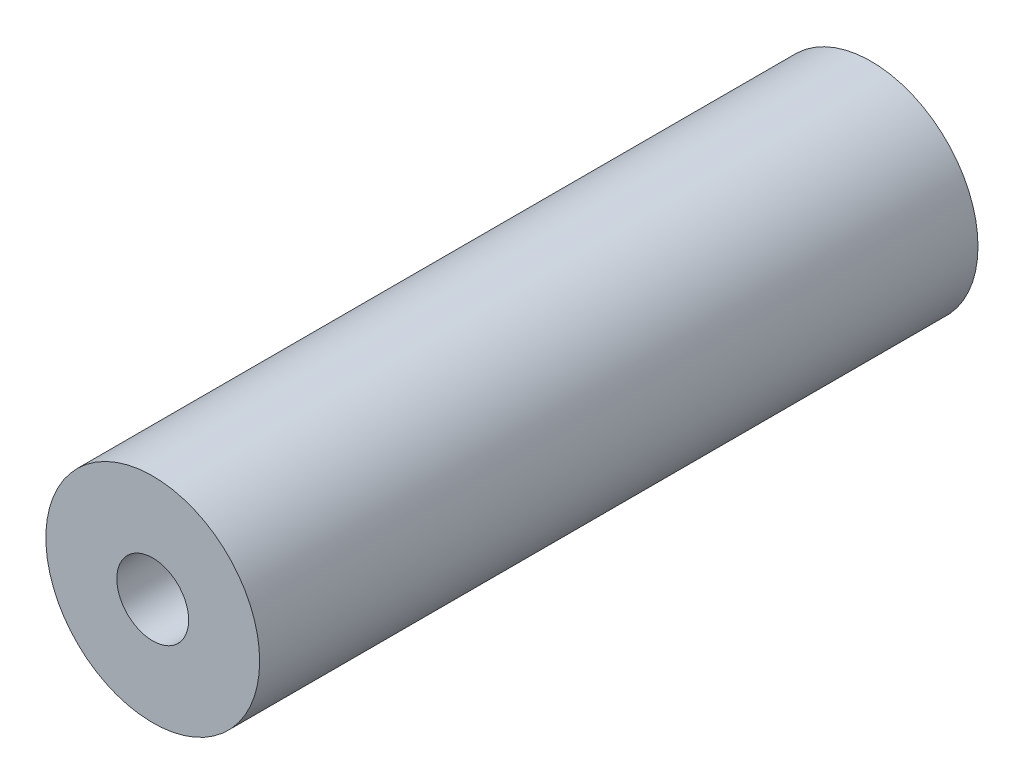
ISO-10303-21;
HEADER;
FILE_DESCRIPTION(('STEP AP214'),'2;1');
FILE_NAME('part.step','',(''),(''),'','','');
FILE_SCHEMA(('AUTOMOTIVE_DESIGN { 1 0 10303 214 1 1 1 1 }'));
ENDSEC;
DATA;
#1=APPLICATION_CONTEXT('core data for automotive mechanical design processes');
#2=APPLICATION_PROTOCOL_DEFINITION('international standard','automotive_design',2000,#1);
#3=PRODUCT_CONTEXT('',#1,'mechanical');
#4=PRODUCT('Part','Part','',(#3));
#5=PRODUCT_RELATED_PRODUCT_CATEGORY('part','',(#4));
#6=PRODUCT_DEFINITION_FORMATION('','',#4);
#7=PRODUCT_DEFINITION_CONTEXT('part definition',#1,'design');
#8=PRODUCT_DEFINITION('design','',#6,#7);
#9=PRODUCT_DEFINITION_SHAPE('','',#8);
#10=(LENGTH_UNIT() NAMED_UNIT(*) SI_UNIT(.MILLI.,.METRE.));
#11=(NAMED_UNIT(*) PLANE_ANGLE_UNIT() SI_UNIT($,.RADIAN.));
#12=(NAMED_UNIT(*) SI_UNIT($,.STERADIAN.) SOLID_ANGLE_UNIT());
#13=UNCERTAINTY_MEASURE_WITH_UNIT(LENGTH_MEASURE(1.E-05),#10,'distance_accuracy_value','');
#14=(GEOMETRIC_REPRESENTATION_CONTEXT(3) GLOBAL_UNCERTAINTY_ASSIGNED_CONTEXT((#13)) GLOBAL_UNIT_ASSIGNED_CONTEXT((#10,
#11,#12)) REPRESENTATION_CONTEXT('',''));
#15=CARTESIAN_POINT('',(0.,0.,0.));
#16=DIRECTION('',(0.,0.,1.));
#17=DIRECTION('',(1.,0.,0.));
#18=AXIS2_PLACEMENT_3D('',#15,#16,#17);
#19=CARTESIAN_POINT('',(0.,0.,-21.));
#20=DIRECTION('',(0.,0.,1.));
#21=DIRECTION('',(1.,0.,0.));
#22=AXIS2_PLACEMENT_3D('',#19,#20,#21);
#23=PLANE('',#22);
#24=CARTESIAN_POINT('',(0.,0.,-21.));
#25=DIRECTION('',(0.,0.,1.));
#26=DIRECTION('',(1.,0.,0.));
#27=AXIS2_PLACEMENT_3D('',#24,#25,#26);
#28=CIRCLE('',#27,6.25);
#29=CARTESIAN_POINT('',(6.25,0.,-21.));
#30=VERTEX_POINT('',#29);
#31=EDGE_CURVE('E11',#30,#30,#28,.T.);
#32=ORIENTED_EDGE('',*,*,#31,.F.);
#33=EDGE_LOOP('',(#32));
#34=FACE_BOUND('',#33,.T.);
#35=CARTESIAN_POINT('',(0.,0.,-21.));
#36=DIRECTION('',(0.,0.,1.));
#37=DIRECTION('',(1.,0.,0.));
#38=AXIS2_PLACEMENT_3D('',#35,#36,#37);
#39=CIRCLE('',#38,2.1);
#40=CARTESIAN_POINT('',(2.1,0.,-21.));
#41=VERTEX_POINT('',#40);
#42=EDGE_CURVE('E20',#41,#41,#39,.T.);
#43=ORIENTED_EDGE('',*,*,#42,.T.);
#44=EDGE_LOOP('',(#43));
#45=FACE_BOUND('',#44,.T.);
#46=ADVANCED_FACE('F16',(#34,#45),#23,.F.);
#47=CARTESIAN_POINT('',(0.,0.,21.));
#48=DIRECTION('',(0.,0.,1.));
#49=DIRECTION('',(1.,0.,0.));
#50=AXIS2_PLACEMENT_3D('',#47,#48,#49);
#51=PLANE('',#50);
#52=CARTESIAN_POINT('',(0.,0.,21.));
#53=DIRECTION('',(0.,0.,1.));
#54=DIRECTION('',(1.,0.,0.));
#55=AXIS2_PLACEMENT_3D('',#52,#53,#54);
#56=CIRCLE('',#55,6.25);
#57=CARTESIAN_POINT('',(6.25,0.,21.));
#58=VERTEX_POINT('',#57);
#59=EDGE_CURVE('E27',#58,#58,#56,.T.);
#60=ORIENTED_EDGE('',*,*,#59,.T.);
#61=EDGE_LOOP('',(#60));
#62=FACE_BOUND('',#61,.T.);
#63=CARTESIAN_POINT('',(0.,0.,21.));
#64=DIRECTION('',(0.,0.,1.));
#65=DIRECTION('',(1.,0.,0.));
#66=AXIS2_PLACEMENT_3D('',#63,#64,#65);
#67=CIRCLE('',#66,2.1);
#68=CARTESIAN_POINT('',(2.1,0.,21.));
#69=VERTEX_POINT('',#68);
#70=EDGE_CURVE('E52',#69,#69,#67,.T.);
#71=ORIENTED_EDGE('',*,*,#70,.F.);
#72=EDGE_LOOP('',(#71));
#73=FACE_BOUND('',#72,.T.);
#74=ADVANCED_FACE('F64',(#62,#73),#51,.T.);
#75=CARTESIAN_POINT('',(0.,0.,21.));
#76=DIRECTION('',(0.,0.,-1.));
#77=DIRECTION('',(-1.,0.,0.));
#78=AXIS2_PLACEMENT_3D('',#75,#76,#77);
#79=CYLINDRICAL_SURFACE('',#78,6.25);
#80=ORIENTED_EDGE('',*,*,#31,.T.);
#81=EDGE_LOOP('',(#80));
#82=FACE_BOUND('',#81,.T.);
#83=ORIENTED_EDGE('',*,*,#59,.F.);
#84=EDGE_LOOP('',(#83));
#85=FACE_BOUND('',#84,.T.);
#86=ADVANCED_FACE('F18',(#82,#85),#79,.T.);
#87=CARTESIAN_POINT('',(0.,0.,21.));
#88=DIRECTION('',(0.,0.,-1.));
#89=DIRECTION('',(-1.,0.,0.));
#90=AXIS2_PLACEMENT_3D('',#87,#88,#89);
#91=CYLINDRICAL_SURFACE('',#90,2.1);
#92=ORIENTED_EDGE('',*,*,#42,.F.);
#93=EDGE_LOOP('',(#92));
#94=FACE_BOUND('',#93,.T.);
#95=ORIENTED_EDGE('',*,*,#70,.T.);
#96=EDGE_LOOP('',(#95));
#97=FACE_BOUND('',#96,.T.);
#98=ADVANCED_FACE('F53',(#94,#97),#91,.F.);
#99=CLOSED_SHELL('',(#46,#74,#86,#98));
#100=MANIFOLD_SOLID_BREP('B1',#99);
#101=ADVANCED_BREP_SHAPE_REPRESENTATION('',(#18,#100),#14);
#102=SHAPE_DEFINITION_REPRESENTATION(#9,#101);
ENDSEC;
END-ISO-10303-21;
